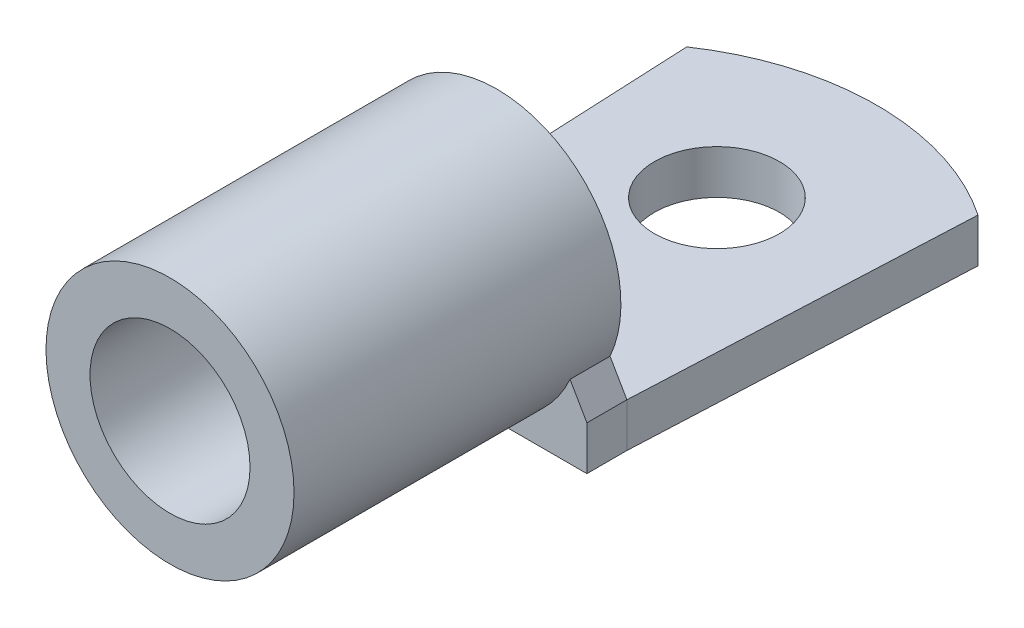
ISO-10303-21;
HEADER;
FILE_DESCRIPTION(('STEP AP214'),'2;1');
FILE_NAME('part.step','',(''),(''),'','','');
FILE_SCHEMA(('AUTOMOTIVE_DESIGN { 1 0 10303 214 1 1 1 1 }'));
ENDSEC;
DATA;
#1=APPLICATION_CONTEXT('core data for automotive mechanical design processes');
#2=APPLICATION_PROTOCOL_DEFINITION('international standard','automotive_design',2000,#1);
#3=PRODUCT_CONTEXT('',#1,'mechanical');
#4=PRODUCT('Part','Part','',(#3));
#5=PRODUCT_RELATED_PRODUCT_CATEGORY('part','',(#4));
#6=PRODUCT_DEFINITION_FORMATION('','',#4);
#7=PRODUCT_DEFINITION_CONTEXT('part definition',#1,'design');
#8=PRODUCT_DEFINITION('design','',#6,#7);
#9=PRODUCT_DEFINITION_SHAPE('','',#8);
#10=(LENGTH_UNIT() NAMED_UNIT(*) SI_UNIT(.MILLI.,.METRE.));
#11=(NAMED_UNIT(*) PLANE_ANGLE_UNIT() SI_UNIT($,.RADIAN.));
#12=(NAMED_UNIT(*) SI_UNIT($,.STERADIAN.) SOLID_ANGLE_UNIT());
#13=UNCERTAINTY_MEASURE_WITH_UNIT(LENGTH_MEASURE(1.E-05),#10,'distance_accuracy_value','');
#14=(GEOMETRIC_REPRESENTATION_CONTEXT(3) GLOBAL_UNCERTAINTY_ASSIGNED_CONTEXT((#13)) GLOBAL_UNIT_ASSIGNED_CONTEXT((#10,
#11,#12)) REPRESENTATION_CONTEXT('',''));
#15=CARTESIAN_POINT('',(0.,0.,0.));
#16=DIRECTION('',(0.,0.,1.));
#17=DIRECTION('',(1.,0.,0.));
#18=AXIS2_PLACEMENT_3D('',#15,#16,#17);
#19=CARTESIAN_POINT('',(0.,2.794,6.35));
#20=DIRECTION('',(0.,-1.,0.));
#21=DIRECTION('',(0.,0.,-1.));
#22=AXIS2_PLACEMENT_3D('',#19,#20,#21);
#23=PLANE('',#22);
#24=CARTESIAN_POINT('',(0.,2.794,6.35));
#25=DIRECTION('',(0.,1.,0.));
#26=DIRECTION('',(0.,0.,-1.));
#27=AXIS2_PLACEMENT_3D('',#24,#25,#26);
#28=CIRCLE('',#27,16.51);
#29=CARTESIAN_POINT('',(9.2456,2.794,-7.32841294302815));
#30=VERTEX_POINT('',#29);
#31=CARTESIAN_POINT('',(-9.2456,2.794,-7.32841294302815));
#32=VERTEX_POINT('',#31);
#33=EDGE_CURVE('E152',#30,#32,#28,.T.);
#34=ORIENTED_EDGE('',*,*,#33,.T.);
#35=DIRECTION('',(0.0464602828088337,0.,0.998920138009703));
#36=VECTOR('',#35,1.);
#37=CARTESIAN_POINT('',(-9.2456,2.794,-7.32841294302815));
#38=LINE('',#37,#36);
#39=CARTESIAN_POINT('',(-8.255,2.794,13.97));
#40=VERTEX_POINT('',#39);
#41=EDGE_CURVE('E155',#32,#40,#38,.T.);
#42=ORIENTED_EDGE('',*,*,#41,.T.);
#43=DIRECTION('',(1.,0.,0.));
#44=VECTOR('',#43,1.);
#45=CARTESIAN_POINT('',(-8.255,2.794,13.97));
#46=LINE('',#45,#44);
#47=CARTESIAN_POINT('',(8.255,2.794,13.97));
#48=VERTEX_POINT('',#47);
#49=EDGE_CURVE('E157',#40,#48,#46,.T.);
#50=ORIENTED_EDGE('',*,*,#49,.T.);
#51=DIRECTION('',(0.0464602828088336,0.,-0.998920138009703));
#52=VECTOR('',#51,1.);
#53=CARTESIAN_POINT('',(9.2456,2.794,-7.32841294302815));
#54=LINE('',#53,#52);
#55=EDGE_CURVE('E159',#48,#30,#54,.T.);
#56=ORIENTED_EDGE('',*,*,#55,.T.);
#57=EDGE_LOOP('',(#34,#42,#50,#56));
#58=FACE_BOUND('',#57,.T.);
#59=CARTESIAN_POINT('',(0.,2.794,0.));
#60=DIRECTION('',(0.,1.,0.));
#61=DIRECTION('',(0.,0.,1.));
#62=AXIS2_PLACEMENT_3D('',#59,#60,#61);
#63=CIRCLE('',#62,3.96875);
#64=CARTESIAN_POINT('',(0.,2.794,3.96875));
#65=VERTEX_POINT('',#64);
#66=EDGE_CURVE('E146',#65,#65,#63,.T.);
#67=ORIENTED_EDGE('',*,*,#66,.F.);
#68=EDGE_LOOP('',(#67));
#69=FACE_BOUND('',#68,.T.);
#70=ADVANCED_FACE('F37',(#58,#69),#23,.F.);
#71=CARTESIAN_POINT('',(0.,0.,6.35));
#72=DIRECTION('',(0.,-1.,0.));
#73=DIRECTION('',(0.,0.,-1.));
#74=AXIS2_PLACEMENT_3D('',#71,#72,#73);
#75=PLANE('',#74);
#76=CARTESIAN_POINT('',(0.,0.,6.35));
#77=DIRECTION('',(0.,1.,0.));
#78=DIRECTION('',(0.,0.,-1.));
#79=AXIS2_PLACEMENT_3D('',#76,#77,#78);
#80=CIRCLE('',#79,16.51);
#81=CARTESIAN_POINT('',(9.2456,0.,-7.32841294302815));
#82=VERTEX_POINT('',#81);
#83=CARTESIAN_POINT('',(-9.2456,0.,-7.32841294302815));
#84=VERTEX_POINT('',#83);
#85=EDGE_CURVE('E149',#82,#84,#80,.T.);
#86=ORIENTED_EDGE('',*,*,#85,.F.);
#87=DIRECTION('',(0.0464602828088336,0.,-0.998920138009703));
#88=VECTOR('',#87,1.);
#89=CARTESIAN_POINT('',(9.2456,0.,-7.32841294302815));
#90=LINE('',#89,#88);
#91=CARTESIAN_POINT('',(8.255,0.,13.97));
#92=VERTEX_POINT('',#91);
#93=EDGE_CURVE('E130',#92,#82,#90,.T.);
#94=ORIENTED_EDGE('',*,*,#93,.F.);
#95=DIRECTION('',(0.,0.,-1.));
#96=VECTOR('',#95,1.);
#97=CARTESIAN_POINT('',(8.255,0.,16.51));
#98=LINE('',#97,#96);
#99=CARTESIAN_POINT('',(8.255,0.,16.51));
#100=VERTEX_POINT('',#99);
#101=EDGE_CURVE('E120',#100,#92,#98,.T.);
#102=ORIENTED_EDGE('',*,*,#101,.F.);
#103=DIRECTION('',(1.,0.,0.));
#104=VECTOR('',#103,1.);
#105=CARTESIAN_POINT('',(0.,0.,16.51));
#106=LINE('',#105,#104);
#107=CARTESIAN_POINT('',(0.,0.,16.51));
#108=VERTEX_POINT('',#107);
#109=EDGE_CURVE('E102',#108,#100,#106,.T.);
#110=ORIENTED_EDGE('',*,*,#109,.F.);
#111=CARTESIAN_POINT('',(-8.255,0.,16.51));
#112=VERTEX_POINT('',#111);
#113=EDGE_CURVE('E113',#112,#108,#106,.T.);
#114=ORIENTED_EDGE('',*,*,#113,.F.);
#115=DIRECTION('',(0.,0.,-1.));
#116=VECTOR('',#115,1.);
#117=CARTESIAN_POINT('',(-8.255,0.,16.51));
#118=LINE('',#117,#116);
#119=CARTESIAN_POINT('',(-8.255,0.,13.97));
#120=VERTEX_POINT('',#119);
#121=EDGE_CURVE('E183',#112,#120,#118,.T.);
#122=ORIENTED_EDGE('',*,*,#121,.T.);
#123=DIRECTION('',(0.0464602828088337,0.,0.998920138009703));
#124=VECTOR('',#123,1.);
#125=CARTESIAN_POINT('',(-9.2456,0.,-7.32841294302815));
#126=LINE('',#125,#124);
#127=EDGE_CURVE('E164',#84,#120,#126,.T.);
#128=ORIENTED_EDGE('',*,*,#127,.F.);
#129=EDGE_LOOP('',(#86,#94,#102,#110,#114,#122,#128));
#130=FACE_BOUND('',#129,.T.);
#131=CARTESIAN_POINT('',(0.,0.,0.));
#132=DIRECTION('',(0.,1.,0.));
#133=DIRECTION('',(0.,0.,1.));
#134=AXIS2_PLACEMENT_3D('',#131,#132,#133);
#135=CIRCLE('',#134,3.96875);
#136=CARTESIAN_POINT('',(0.,0.,3.96875));
#137=VERTEX_POINT('',#136);
#138=EDGE_CURVE('E144',#137,#137,#135,.T.);
#139=ORIENTED_EDGE('',*,*,#138,.T.);
#140=EDGE_LOOP('',(#139));
#141=FACE_BOUND('',#140,.T.);
#142=ADVANCED_FACE('F128',(#130,#141),#75,.T.);
#143=CARTESIAN_POINT('',(0.,2.794,6.35));
#144=DIRECTION('',(0.,-1.,0.));
#145=DIRECTION('',(0.,0.,-1.));
#146=AXIS2_PLACEMENT_3D('',#143,#144,#145);
#147=CYLINDRICAL_SURFACE('',#146,16.51);
#148=ORIENTED_EDGE('',*,*,#85,.T.);
#149=DIRECTION('',(0.,-1.,0.));
#150=VECTOR('',#149,1.);
#151=CARTESIAN_POINT('',(-9.2456,2.794,-7.32841294302815));
#152=LINE('',#151,#150);
#153=EDGE_CURVE('E45',#32,#84,#152,.T.);
#154=ORIENTED_EDGE('',*,*,#153,.F.);
#155=ORIENTED_EDGE('',*,*,#33,.F.);
#156=DIRECTION('',(0.,-1.,0.));
#157=VECTOR('',#156,1.);
#158=CARTESIAN_POINT('',(9.2456,2.794,-7.32841294302815));
#159=LINE('',#158,#157);
#160=EDGE_CURVE('E161',#30,#82,#159,.T.);
#161=ORIENTED_EDGE('',*,*,#160,.T.);
#162=EDGE_LOOP('',(#148,#154,#155,#161));
#163=FACE_BOUND('',#162,.T.);
#164=ADVANCED_FACE('F39',(#163),#147,.T.);
#165=CARTESIAN_POINT('',(-9.2456,2.794,-7.32841294302815));
#166=DIRECTION('',(0.998920138009703,0.,-0.0464602828088337));
#167=DIRECTION('',(-0.0464602828088337,0.,-0.998920138009703));
#168=AXIS2_PLACEMENT_3D('',#165,#166,#167);
#169=PLANE('',#168);
#170=ORIENTED_EDGE('',*,*,#127,.T.);
#171=DIRECTION('',(0.,-1.,0.));
#172=VECTOR('',#171,1.);
#173=CARTESIAN_POINT('',(-8.255,2.794,13.97));
#174=LINE('',#173,#172);
#175=EDGE_CURVE('E171',#40,#120,#174,.T.);
#176=ORIENTED_EDGE('',*,*,#175,.F.);
#177=ORIENTED_EDGE('',*,*,#41,.F.);
#178=ORIENTED_EDGE('',*,*,#153,.T.);
#179=EDGE_LOOP('',(#170,#176,#177,#178));
#180=FACE_BOUND('',#179,.T.);
#181=ADVANCED_FACE('F176',(#180),#169,.F.);
#182=CARTESIAN_POINT('',(9.2456,2.794,-7.32841294302815));
#183=DIRECTION('',(-0.998920138009703,0.,-0.0464602828088336));
#184=DIRECTION('',(-0.0464602828088336,0.,0.998920138009703));
#185=AXIS2_PLACEMENT_3D('',#182,#183,#184);
#186=PLANE('',#185);
#187=ORIENTED_EDGE('',*,*,#93,.T.);
#188=ORIENTED_EDGE('',*,*,#160,.F.);
#189=ORIENTED_EDGE('',*,*,#55,.F.);
#190=DIRECTION('',(0.,-1.,0.));
#191=VECTOR('',#190,1.);
#192=CARTESIAN_POINT('',(8.255,2.794,13.97));
#193=LINE('',#192,#191);
#194=EDGE_CURVE('E169',#48,#92,#193,.T.);
#195=ORIENTED_EDGE('',*,*,#194,.T.);
#196=EDGE_LOOP('',(#187,#188,#189,#195));
#197=FACE_BOUND('',#196,.T.);
#198=ADVANCED_FACE('F223',(#197),#186,.F.);
#199=CARTESIAN_POINT('',(0.,2.794,0.));
#200=DIRECTION('',(0.,-1.,0.));
#201=DIRECTION('',(0.,0.,-1.));
#202=AXIS2_PLACEMENT_3D('',#199,#200,#201);
#203=CYLINDRICAL_SURFACE('',#202,3.96875);
#204=ORIENTED_EDGE('',*,*,#66,.T.);
#205=EDGE_LOOP('',(#204));
#206=FACE_BOUND('',#205,.T.);
#207=ORIENTED_EDGE('',*,*,#138,.F.);
#208=EDGE_LOOP('',(#207));
#209=FACE_BOUND('',#208,.T.);
#210=ADVANCED_FACE('F225',(#206,#209),#203,.F.);
#211=CARTESIAN_POINT('',(0.,7.874,13.97));
#212=DIRECTION('',(0.,0.,1.));
#213=DIRECTION('',(1.,0.,0.));
#214=AXIS2_PLACEMENT_3D('',#211,#212,#213);
#215=PLANE('',#214);
#216=DIRECTION('',(-0.500000000000004,0.866025403784436,0.));
#217=VECTOR('',#216,1.);
#218=CARTESIAN_POINT('',(7.40108748908684,4.2730198541203,13.97));
#219=LINE('',#218,#217);
#220=CARTESIAN_POINT('',(7.18359140794886,4.64973411709839,13.97));
#221=VERTEX_POINT('',#220);
#222=EDGE_CURVE('E203',#48,#221,#219,.T.);
#223=ORIENTED_EDGE('',*,*,#222,.F.);
#224=ORIENTED_EDGE('',*,*,#49,.F.);
#225=DIRECTION('',(0.500000000000005,0.866025403784436,0.));
#226=VECTOR('',#225,1.);
#227=CARTESIAN_POINT('',(-7.40108748908683,4.2730198541203,13.97));
#228=LINE('',#227,#226);
#229=CARTESIAN_POINT('',(-7.18359140794886,4.64973411709839,13.97));
#230=VERTEX_POINT('',#229);
#231=EDGE_CURVE('E114',#40,#230,#228,.T.);
#232=ORIENTED_EDGE('',*,*,#231,.T.);
#233=CARTESIAN_POINT('',(0.,7.874,13.97));
#234=DIRECTION('',(0.,0.,1.));
#235=DIRECTION('',(1.,0.,0.));
#236=AXIS2_PLACEMENT_3D('',#233,#234,#235);
#237=CIRCLE('',#236,7.874);
#238=EDGE_CURVE('E140',#221,#230,#237,.T.);
#239=ORIENTED_EDGE('',*,*,#238,.F.);
#240=EDGE_LOOP('',(#223,#224,#232,#239));
#241=FACE_BOUND('',#240,.T.);
#242=ADVANCED_FACE('F218',(#241),#215,.F.);
#243=CARTESIAN_POINT('',(0.,7.874,34.7218));
#244=DIRECTION('',(0.,0.,1.));
#245=DIRECTION('',(1.,0.,0.));
#246=AXIS2_PLACEMENT_3D('',#243,#244,#245);
#247=PLANE('',#246);
#248=CARTESIAN_POINT('',(0.,7.874,34.7218));
#249=DIRECTION('',(0.,0.,1.));
#250=DIRECTION('',(1.,0.,0.));
#251=AXIS2_PLACEMENT_3D('',#248,#249,#250);
#252=CIRCLE('',#251,7.874);
#253=CARTESIAN_POINT('',(7.874,7.874,34.7218));
#254=VERTEX_POINT('',#253);
#255=EDGE_CURVE('E141',#254,#254,#252,.T.);
#256=ORIENTED_EDGE('',*,*,#255,.T.);
#257=EDGE_LOOP('',(#256));
#258=FACE_BOUND('',#257,.T.);
#259=CARTESIAN_POINT('',(0.,7.874,34.7218));
#260=DIRECTION('',(0.,0.,1.));
#261=DIRECTION('',(1.,0.,0.));
#262=AXIS2_PLACEMENT_3D('',#259,#260,#261);
#263=CIRCLE('',#262,5.08);
#264=CARTESIAN_POINT('',(5.08,7.874,34.7218));
#265=VERTEX_POINT('',#264);
#266=EDGE_CURVE('E137',#265,#265,#263,.T.);
#267=ORIENTED_EDGE('',*,*,#266,.F.);
#268=EDGE_LOOP('',(#267));
#269=FACE_BOUND('',#268,.T.);
#270=ADVANCED_FACE('F243',(#258,#269),#247,.T.);
#271=CARTESIAN_POINT('',(0.,7.874,34.7218));
#272=DIRECTION('',(0.,0.,-1.));
#273=DIRECTION('',(-1.,0.,0.));
#274=AXIS2_PLACEMENT_3D('',#271,#272,#273);
#275=CYLINDRICAL_SURFACE('',#274,7.874);
#276=CARTESIAN_POINT('',(0.,7.874,16.51));
#277=DIRECTION('',(0.,0.,1.));
#278=DIRECTION('',(1.,0.,0.));
#279=AXIS2_PLACEMENT_3D('',#276,#277,#278);
#280=CIRCLE('',#279,7.874);
#281=CARTESIAN_POINT('',(7.18359140794886,4.64973411709839,16.51));
#282=VERTEX_POINT('',#281);
#283=EDGE_CURVE('E108',#108,#282,#280,.T.);
#284=ORIENTED_EDGE('',*,*,#283,.T.);
#285=DIRECTION('',(0.,0.,-1.));
#286=VECTOR('',#285,1.);
#287=CARTESIAN_POINT('',(7.18359140794886,4.64973411709839,16.51));
#288=LINE('',#287,#286);
#289=EDGE_CURVE('E133',#282,#221,#288,.T.);
#290=ORIENTED_EDGE('',*,*,#289,.T.);
#291=ORIENTED_EDGE('',*,*,#238,.T.);
#292=DIRECTION('',(0.,0.,-1.));
#293=VECTOR('',#292,1.);
#294=CARTESIAN_POINT('',(-7.18359140794886,4.64973411709839,16.51));
#295=LINE('',#294,#293);
#296=CARTESIAN_POINT('',(-7.18359140794886,4.64973411709839,16.51));
#297=VERTEX_POINT('',#296);
#298=EDGE_CURVE('E57',#297,#230,#295,.T.);
#299=ORIENTED_EDGE('',*,*,#298,.F.);
#300=EDGE_CURVE('E52',#297,#108,#280,.T.);
#301=ORIENTED_EDGE('',*,*,#300,.T.);
#302=EDGE_LOOP('',(#284,#290,#291,#299,#301));
#303=FACE_BOUND('',#302,.T.);
#304=ORIENTED_EDGE('',*,*,#255,.F.);
#305=EDGE_LOOP('',(#304));
#306=FACE_BOUND('',#305,.T.);
#307=ADVANCED_FACE('F199',(#303,#306),#275,.T.);
#308=CARTESIAN_POINT('',(0.,7.874,34.7218));
#309=DIRECTION('',(0.,0.,-1.));
#310=DIRECTION('',(-1.,0.,0.));
#311=AXIS2_PLACEMENT_3D('',#308,#309,#310);
#312=CYLINDRICAL_SURFACE('',#311,5.08);
#313=CARTESIAN_POINT('',(0.,7.874,16.51));
#314=DIRECTION('',(0.,0.,1.));
#315=DIRECTION('',(1.,0.,0.));
#316=AXIS2_PLACEMENT_3D('',#313,#314,#315);
#317=CIRCLE('',#316,5.08);
#318=CARTESIAN_POINT('',(5.08,7.874,16.51));
#319=VERTEX_POINT('',#318);
#320=EDGE_CURVE('E11',#319,#319,#317,.T.);
#321=ORIENTED_EDGE('',*,*,#320,.F.);
#322=EDGE_LOOP('',(#321));
#323=FACE_BOUND('',#322,.T.);
#324=ORIENTED_EDGE('',*,*,#266,.T.);
#325=EDGE_LOOP('',(#324));
#326=FACE_BOUND('',#325,.T.);
#327=ADVANCED_FACE('F242',(#323,#326),#312,.F.);
#328=CARTESIAN_POINT('',(0.,0.,16.51));
#329=DIRECTION('',(0.,0.,1.));
#330=DIRECTION('',(1.,0.,0.));
#331=AXIS2_PLACEMENT_3D('',#328,#329,#330);
#332=PLANE('',#331);
#333=ORIENTED_EDGE('',*,*,#320,.T.);
#334=EDGE_LOOP('',(#333));
#335=FACE_BOUND('',#334,.T.);
#336=ADVANCED_FACE('F251',(#335),#332,.T.);
#337=ORIENTED_EDGE('',*,*,#300,.F.);
#338=DIRECTION('',(0.500000000000005,0.866025403784436,0.));
#339=VECTOR('',#338,1.);
#340=CARTESIAN_POINT('',(-7.40108748908683,4.2730198541203,16.51));
#341=LINE('',#340,#339);
#342=CARTESIAN_POINT('',(-8.255,2.794,16.51));
#343=VERTEX_POINT('',#342);
#344=EDGE_CURVE('E191',#343,#297,#341,.T.);
#345=ORIENTED_EDGE('',*,*,#344,.F.);
#346=DIRECTION('',(0.,-1.,0.));
#347=VECTOR('',#346,1.);
#348=CARTESIAN_POINT('',(-8.255,0.,16.51));
#349=LINE('',#348,#347);
#350=EDGE_CURVE('E187',#343,#112,#349,.T.);
#351=ORIENTED_EDGE('',*,*,#350,.T.);
#352=ORIENTED_EDGE('',*,*,#113,.T.);
#353=EDGE_LOOP('',(#337,#345,#351,#352));
#354=FACE_BOUND('',#353,.T.);
#355=ADVANCED_FACE('F212',(#354),#332,.T.);
#356=CARTESIAN_POINT('',(8.255,0.,16.51));
#357=DIRECTION('',(-1.,0.,0.));
#358=DIRECTION('',(0.,0.,1.));
#359=AXIS2_PLACEMENT_3D('',#356,#357,#358);
#360=PLANE('',#359);
#361=ORIENTED_EDGE('',*,*,#194,.F.);
#362=DIRECTION('',(0.,0.,-1.));
#363=VECTOR('',#362,1.);
#364=CARTESIAN_POINT('',(8.255,2.794,16.51));
#365=LINE('',#364,#363);
#366=CARTESIAN_POINT('',(8.255,2.794,16.51));
#367=VERTEX_POINT('',#366);
#368=EDGE_CURVE('E122',#367,#48,#365,.T.);
#369=ORIENTED_EDGE('',*,*,#368,.F.);
#370=DIRECTION('',(0.,1.,0.));
#371=VECTOR('',#370,1.);
#372=CARTESIAN_POINT('',(8.255,0.,16.51));
#373=LINE('',#372,#371);
#374=EDGE_CURVE('E106',#100,#367,#373,.T.);
#375=ORIENTED_EDGE('',*,*,#374,.F.);
#376=ORIENTED_EDGE('',*,*,#101,.T.);
#377=EDGE_LOOP('',(#361,#369,#375,#376));
#378=FACE_BOUND('',#377,.T.);
#379=ADVANCED_FACE('F119',(#378),#360,.F.);
#380=CARTESIAN_POINT('',(7.40108748908684,4.2730198541203,16.51));
#381=DIRECTION('',(-0.866025403784436,-0.500000000000004,0.));
#382=DIRECTION('',(0.500000000000004,-0.866025403784436,0.));
#383=AXIS2_PLACEMENT_3D('',#380,#381,#382);
#384=PLANE('',#383);
#385=ORIENTED_EDGE('',*,*,#222,.T.);
#386=ORIENTED_EDGE('',*,*,#289,.F.);
#387=DIRECTION('',(-0.500000000000004,0.866025403784436,0.));
#388=VECTOR('',#387,1.);
#389=CARTESIAN_POINT('',(7.40108748908684,4.2730198541203,16.51));
#390=LINE('',#389,#388);
#391=EDGE_CURVE('E124',#367,#282,#390,.T.);
#392=ORIENTED_EDGE('',*,*,#391,.F.);
#393=ORIENTED_EDGE('',*,*,#368,.T.);
#394=EDGE_LOOP('',(#385,#386,#392,#393));
#395=FACE_BOUND('',#394,.T.);
#396=ADVANCED_FACE('F204',(#395),#384,.F.);
#397=CARTESIAN_POINT('',(-7.40108748908683,4.2730198541203,16.51));
#398=DIRECTION('',(-0.866025403784436,0.500000000000005,0.));
#399=DIRECTION('',(-0.500000000000005,-0.866025403784436,0.));
#400=AXIS2_PLACEMENT_3D('',#397,#398,#399);
#401=PLANE('',#400);
#402=ORIENTED_EDGE('',*,*,#231,.F.);
#403=DIRECTION('',(0.,0.,-1.));
#404=VECTOR('',#403,1.);
#405=CARTESIAN_POINT('',(-8.255,2.794,16.51));
#406=LINE('',#405,#404);
#407=EDGE_CURVE('E186',#343,#40,#406,.T.);
#408=ORIENTED_EDGE('',*,*,#407,.F.);
#409=ORIENTED_EDGE('',*,*,#344,.T.);
#410=ORIENTED_EDGE('',*,*,#298,.T.);
#411=EDGE_LOOP('',(#402,#408,#409,#410));
#412=FACE_BOUND('',#411,.T.);
#413=ADVANCED_FACE('F217',(#412),#401,.T.);
#414=CARTESIAN_POINT('',(-8.255,0.,16.51));
#415=DIRECTION('',(1.,0.,0.));
#416=DIRECTION('',(0.,0.,-1.));
#417=AXIS2_PLACEMENT_3D('',#414,#415,#416);
#418=PLANE('',#417);
#419=ORIENTED_EDGE('',*,*,#175,.T.);
#420=ORIENTED_EDGE('',*,*,#121,.F.);
#421=ORIENTED_EDGE('',*,*,#350,.F.);
#422=ORIENTED_EDGE('',*,*,#407,.T.);
#423=EDGE_LOOP('',(#419,#420,#421,#422));
#424=FACE_BOUND('',#423,.T.);
#425=ADVANCED_FACE('F214',(#424),#418,.F.);
#426=ORIENTED_EDGE('',*,*,#283,.F.);
#427=ORIENTED_EDGE('',*,*,#109,.T.);
#428=ORIENTED_EDGE('',*,*,#374,.T.);
#429=ORIENTED_EDGE('',*,*,#391,.T.);
#430=EDGE_LOOP('',(#426,#427,#428,#429));
#431=FACE_BOUND('',#430,.T.);
#432=ADVANCED_FACE('F104',(#431),#332,.T.);
#433=CLOSED_SHELL('',(#70,#142,#164,#181,#198,#210,#242,#270,#307,#327,#336,#355,#379,#396,#413,
#425,#432));
#434=MANIFOLD_SOLID_BREP('B2',#433);
#435=ADVANCED_BREP_SHAPE_REPRESENTATION('',(#18,#434),#14);
#436=SHAPE_DEFINITION_REPRESENTATION(#9,#435);
ENDSEC;
END-ISO-10303-21;
